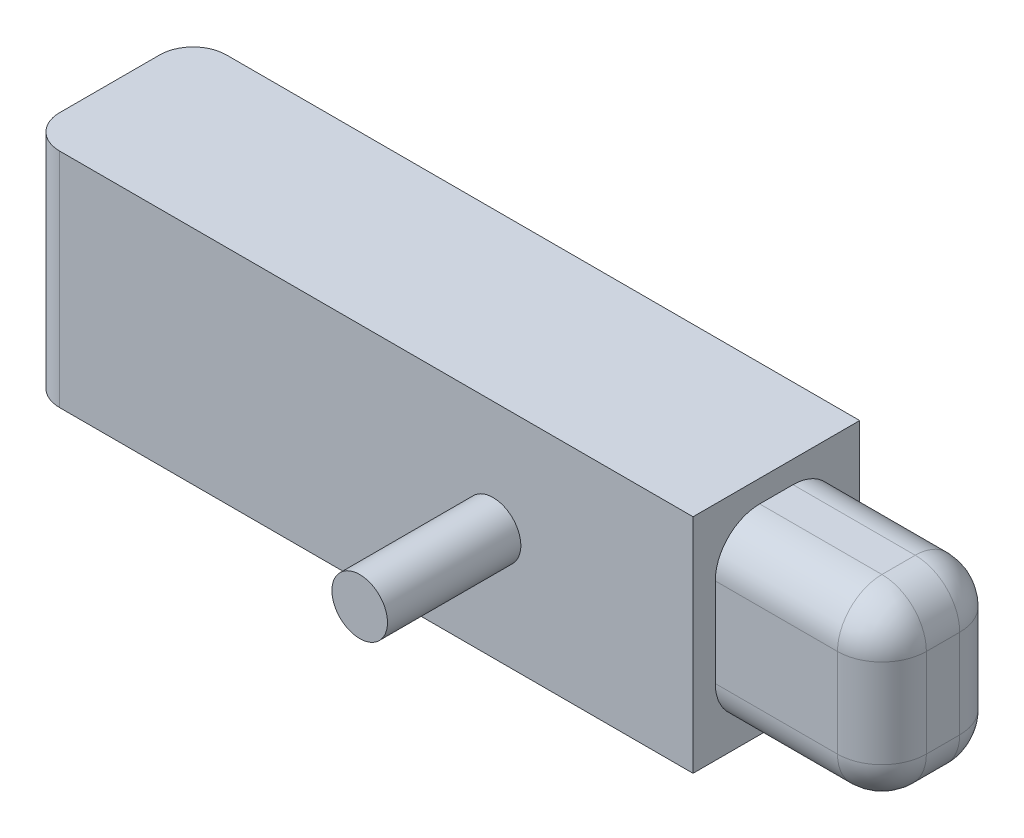
ISO-10303-21;
HEADER;
FILE_DESCRIPTION(('STEP AP214'),'2;1');
FILE_NAME('part.step','',(''),(''),'','','');
FILE_SCHEMA(('AUTOMOTIVE_DESIGN { 1 0 10303 214 1 1 1 1 }'));
ENDSEC;
DATA;
#1=APPLICATION_CONTEXT('core data for automotive mechanical design processes');
#2=APPLICATION_PROTOCOL_DEFINITION('international standard','automotive_design',2000,#1);
#3=PRODUCT_CONTEXT('',#1,'mechanical');
#4=PRODUCT('Part','Part','',(#3));
#5=PRODUCT_RELATED_PRODUCT_CATEGORY('part','',(#4));
#6=PRODUCT_DEFINITION_FORMATION('','',#4);
#7=PRODUCT_DEFINITION_CONTEXT('part definition',#1,'design');
#8=PRODUCT_DEFINITION('design','',#6,#7);
#9=PRODUCT_DEFINITION_SHAPE('','',#8);
#10=(LENGTH_UNIT() NAMED_UNIT(*) SI_UNIT(.MILLI.,.METRE.));
#11=(NAMED_UNIT(*) PLANE_ANGLE_UNIT() SI_UNIT($,.RADIAN.));
#12=(NAMED_UNIT(*) SI_UNIT($,.STERADIAN.) SOLID_ANGLE_UNIT());
#13=UNCERTAINTY_MEASURE_WITH_UNIT(LENGTH_MEASURE(1.E-05),#10,'distance_accuracy_value','');
#14=(GEOMETRIC_REPRESENTATION_CONTEXT(3) GLOBAL_UNCERTAINTY_ASSIGNED_CONTEXT((#13)) GLOBAL_UNIT_ASSIGNED_CONTEXT((#10,
#11,#12)) REPRESENTATION_CONTEXT('',''));
#15=CARTESIAN_POINT('',(0.,0.,0.));
#16=DIRECTION('',(0.,0.,1.));
#17=DIRECTION('',(1.,0.,0.));
#18=AXIS2_PLACEMENT_3D('',#15,#16,#17);
#19=CARTESIAN_POINT('',(55.594721876326,30.,14.8444549595951));
#20=DIRECTION('',(-1.,0.,0.));
#21=DIRECTION('',(0.,0.,1.));
#22=AXIS2_PLACEMENT_3D('',#19,#20,#21);
#23=PLANE('',#22);
#24=DIRECTION('',(0.,0.,-1.));
#25=VECTOR('',#24,1.);
#26=CARTESIAN_POINT('',(55.594721876326,-10.,14.8444549595951));
#27=LINE('',#26,#25);
#28=CARTESIAN_POINT('',(55.594721876326,-10.,14.8444549595951));
#29=VERTEX_POINT('',#28);
#30=CARTESIAN_POINT('',(55.594721876326,-10.,-15.1555450404049));
#31=VERTEX_POINT('',#30);
#32=EDGE_CURVE('E185',#29,#31,#27,.T.);
#33=ORIENTED_EDGE('',*,*,#32,.T.);
#34=DIRECTION('',(0.,-1.,0.));
#35=VECTOR('',#34,1.);
#36=CARTESIAN_POINT('',(55.594721876326,30.,-15.1555450404049));
#37=LINE('',#36,#35);
#38=CARTESIAN_POINT('',(55.594721876326,30.,-15.1555450404049));
#39=VERTEX_POINT('',#38);
#40=EDGE_CURVE('E171',#39,#31,#37,.T.);
#41=ORIENTED_EDGE('',*,*,#40,.F.);
#42=DIRECTION('',(0.,0.,-1.));
#43=VECTOR('',#42,1.);
#44=CARTESIAN_POINT('',(55.594721876326,30.,14.8444549595951));
#45=LINE('',#44,#43);
#46=CARTESIAN_POINT('',(55.594721876326,30.,14.8444549595951));
#47=VERTEX_POINT('',#46);
#48=EDGE_CURVE('E157',#47,#39,#45,.T.);
#49=ORIENTED_EDGE('',*,*,#48,.F.);
#50=DIRECTION('',(0.,-1.,0.));
#51=VECTOR('',#50,1.);
#52=CARTESIAN_POINT('',(55.594721876326,30.,14.8444549595951));
#53=LINE('',#52,#51);
#54=EDGE_CURVE('E164',#47,#29,#53,.T.);
#55=ORIENTED_EDGE('',*,*,#54,.T.);
#56=EDGE_LOOP('',(#33,#41,#49,#55));
#57=FACE_BOUND('',#56,.T.);
#58=DIRECTION('',(0.,-1.,0.));
#59=VECTOR('',#58,1.);
#60=CARTESIAN_POINT('',(55.594721876326,-6.,10.8444549595951));
#61=LINE('',#60,#59);
#62=CARTESIAN_POINT('',(55.594721876326,18.,10.8444549595951));
#63=VERTEX_POINT('',#62);
#64=CARTESIAN_POINT('',(55.594721876326,2.,10.8444549595951));
#65=VERTEX_POINT('',#64);
#66=EDGE_CURVE('E269',#63,#65,#61,.T.);
#67=ORIENTED_EDGE('',*,*,#66,.F.);
#68=CARTESIAN_POINT('',(55.594721876326,18.,2.84445495959507));
#69=DIRECTION('',(-1.,0.,0.));
#70=DIRECTION('',(0.,0.,1.));
#71=AXIS2_PLACEMENT_3D('',#68,#69,#70);
#72=CIRCLE('',#71,8.);
#73=CARTESIAN_POINT('',(55.594721876326,26.,2.84445495959507));
#74=VERTEX_POINT('',#73);
#75=EDGE_CURVE('E218',#63,#74,#72,.T.);
#76=ORIENTED_EDGE('',*,*,#75,.T.);
#77=DIRECTION('',(0.,0.,1.));
#78=VECTOR('',#77,1.);
#79=CARTESIAN_POINT('',(55.594721876326,26.,-11.1555450404049));
#80=LINE('',#79,#78);
#81=CARTESIAN_POINT('',(55.594721876326,26.,-3.15554504040493));
#82=VERTEX_POINT('',#81);
#83=EDGE_CURVE('E554',#82,#74,#80,.T.);
#84=ORIENTED_EDGE('',*,*,#83,.F.);
#85=CARTESIAN_POINT('',(55.594721876326,18.,-3.15554504040493));
#86=DIRECTION('',(-1.,0.,0.));
#87=DIRECTION('',(0.,0.,1.));
#88=AXIS2_PLACEMENT_3D('',#85,#86,#87);
#89=CIRCLE('',#88,8.);
#90=CARTESIAN_POINT('',(55.594721876326,18.,-11.1555450404049));
#91=VERTEX_POINT('',#90);
#92=EDGE_CURVE('E212',#82,#91,#89,.T.);
#93=ORIENTED_EDGE('',*,*,#92,.T.);
#94=DIRECTION('',(0.,1.,0.));
#95=VECTOR('',#94,1.);
#96=CARTESIAN_POINT('',(55.594721876326,-6.,-11.1555450404049));
#97=LINE('',#96,#95);
#98=CARTESIAN_POINT('',(55.594721876326,2.,-11.1555450404049));
#99=VERTEX_POINT('',#98);
#100=EDGE_CURVE('E557',#99,#91,#97,.T.);
#101=ORIENTED_EDGE('',*,*,#100,.F.);
#102=CARTESIAN_POINT('',(55.594721876326,2.,-3.15554504040493));
#103=DIRECTION('',(-1.,0.,0.));
#104=DIRECTION('',(0.,0.,1.));
#105=AXIS2_PLACEMENT_3D('',#102,#103,#104);
#106=CIRCLE('',#105,8.);
#107=CARTESIAN_POINT('',(55.594721876326,-6.,-3.15554504040493));
#108=VERTEX_POINT('',#107);
#109=EDGE_CURVE('E214',#99,#108,#106,.T.);
#110=ORIENTED_EDGE('',*,*,#109,.T.);
#111=DIRECTION('',(0.,0.,-1.));
#112=VECTOR('',#111,1.);
#113=CARTESIAN_POINT('',(55.594721876326,-6.,-11.1555450404049));
#114=LINE('',#113,#112);
#115=CARTESIAN_POINT('',(55.594721876326,-6.,2.84445495959507));
#116=VERTEX_POINT('',#115);
#117=EDGE_CURVE('E562',#116,#108,#114,.T.);
#118=ORIENTED_EDGE('',*,*,#117,.F.);
#119=CARTESIAN_POINT('',(55.594721876326,2.,2.84445495959507));
#120=DIRECTION('',(-1.,0.,0.));
#121=DIRECTION('',(0.,0.,1.));
#122=AXIS2_PLACEMENT_3D('',#119,#120,#121);
#123=CIRCLE('',#122,8.);
#124=EDGE_CURVE('E216',#116,#65,#123,.T.);
#125=ORIENTED_EDGE('',*,*,#124,.T.);
#126=EDGE_LOOP('',(#67,#76,#84,#93,#101,#110,#118,#125));
#127=FACE_BOUND('',#126,.T.);
#128=ADVANCED_FACE('F40',(#57,#127),#23,.F.);
#129=CARTESIAN_POINT('',(-64.405278123674,30.,14.8444549595951));
#130=DIRECTION('',(1.,0.,0.));
#131=DIRECTION('',(0.,0.,-1.));
#132=AXIS2_PLACEMENT_3D('',#129,#130,#131);
#133=PLANE('',#132);
#134=DIRECTION('',(0.,0.,1.));
#135=VECTOR('',#134,1.);
#136=CARTESIAN_POINT('',(-64.405278123674,30.,14.8444549595951));
#137=LINE('',#136,#135);
#138=CARTESIAN_POINT('',(-64.405278123674,30.,-9.15554504040492));
#139=VERTEX_POINT('',#138);
#140=CARTESIAN_POINT('',(-64.405278123674,30.,8.84445495959508));
#141=VERTEX_POINT('',#140);
#142=EDGE_CURVE('E161',#139,#141,#137,.T.);
#143=ORIENTED_EDGE('',*,*,#142,.F.);
#144=DIRECTION('',(0.,-1.,0.));
#145=VECTOR('',#144,1.);
#146=CARTESIAN_POINT('',(-64.405278123674,30.,-9.15554504040492));
#147=LINE('',#146,#145);
#148=CARTESIAN_POINT('',(-64.405278123674,-10.,-9.15554504040492));
#149=VERTEX_POINT('',#148);
#150=EDGE_CURVE('E271',#139,#149,#147,.T.);
#151=ORIENTED_EDGE('',*,*,#150,.T.);
#152=DIRECTION('',(0.,0.,1.));
#153=VECTOR('',#152,1.);
#154=CARTESIAN_POINT('',(-64.405278123674,-10.,14.8444549595951));
#155=LINE('',#154,#153);
#156=CARTESIAN_POINT('',(-64.405278123674,-10.,8.84445495959508));
#157=VERTEX_POINT('',#156);
#158=EDGE_CURVE('E180',#149,#157,#155,.T.);
#159=ORIENTED_EDGE('',*,*,#158,.T.);
#160=DIRECTION('',(0.,-1.,0.));
#161=VECTOR('',#160,1.);
#162=CARTESIAN_POINT('',(-64.405278123674,30.,8.84445495959508));
#163=LINE('',#162,#161);
#164=EDGE_CURVE('E246',#157,#141,#163,.F.);
#165=ORIENTED_EDGE('',*,*,#164,.T.);
#166=EDGE_LOOP('',(#143,#151,#159,#165));
#167=FACE_BOUND('',#166,.T.);
#168=ADVANCED_FACE('F284',(#167),#133,.F.);
#169=CARTESIAN_POINT('',(55.594721876326,30.,14.8444549595951));
#170=DIRECTION('',(0.,0.,-1.));
#171=DIRECTION('',(-1.,0.,0.));
#172=AXIS2_PLACEMENT_3D('',#169,#170,#171);
#173=PLANE('',#172);
#174=CARTESIAN_POINT('',(19.594721876326,10.,14.8444549595951));
#175=DIRECTION('',(0.,0.,-1.));
#176=DIRECTION('',(-1.,0.,0.));
#177=AXIS2_PLACEMENT_3D('',#174,#175,#176);
#178=CIRCLE('',#177,5.);
#179=CARTESIAN_POINT('',(14.594721876326,10.,14.8444549595951));
#180=VERTEX_POINT('',#179);
#181=EDGE_CURVE('E170',#180,#180,#178,.F.);
#182=ORIENTED_EDGE('',*,*,#181,.F.);
#183=EDGE_LOOP('',(#182));
#184=FACE_BOUND('',#183,.T.);
#185=DIRECTION('',(1.,0.,0.));
#186=VECTOR('',#185,1.);
#187=CARTESIAN_POINT('',(55.594721876326,30.,14.8444549595951));
#188=LINE('',#187,#186);
#189=CARTESIAN_POINT('',(-58.405278123674,30.,14.8444549595951));
#190=VERTEX_POINT('',#189);
#191=EDGE_CURVE('E153',#190,#47,#188,.T.);
#192=ORIENTED_EDGE('',*,*,#191,.F.);
#193=DIRECTION('',(0.,-1.,0.));
#194=VECTOR('',#193,1.);
#195=CARTESIAN_POINT('',(-58.405278123674,30.,14.8444549595951));
#196=LINE('',#195,#194);
#197=CARTESIAN_POINT('',(-58.405278123674,-10.,14.8444549595951));
#198=VERTEX_POINT('',#197);
#199=EDGE_CURVE('E11',#190,#198,#196,.T.);
#200=ORIENTED_EDGE('',*,*,#199,.T.);
#201=DIRECTION('',(1.,0.,0.));
#202=VECTOR('',#201,1.);
#203=CARTESIAN_POINT('',(55.594721876326,-10.,14.8444549595951));
#204=LINE('',#203,#202);
#205=EDGE_CURVE('E167',#198,#29,#204,.T.);
#206=ORIENTED_EDGE('',*,*,#205,.T.);
#207=ORIENTED_EDGE('',*,*,#54,.F.);
#208=EDGE_LOOP('',(#192,#200,#206,#207));
#209=FACE_BOUND('',#208,.T.);
#210=ADVANCED_FACE('F165',(#184,#209),#173,.F.);
#211=CARTESIAN_POINT('',(55.594721876326,30.,-15.1555450404049));
#212=DIRECTION('',(0.,0.,1.));
#213=DIRECTION('',(1.,0.,0.));
#214=AXIS2_PLACEMENT_3D('',#211,#212,#213);
#215=PLANE('',#214);
#216=DIRECTION('',(-1.,0.,0.));
#217=VECTOR('',#216,1.);
#218=CARTESIAN_POINT('',(55.594721876326,-10.,-15.1555450404049));
#219=LINE('',#218,#217);
#220=CARTESIAN_POINT('',(-58.405278123674,-10.,-15.1555450404049));
#221=VERTEX_POINT('',#220);
#222=EDGE_CURVE('E187',#31,#221,#219,.T.);
#223=ORIENTED_EDGE('',*,*,#222,.T.);
#224=DIRECTION('',(0.,-1.,0.));
#225=VECTOR('',#224,1.);
#226=CARTESIAN_POINT('',(-58.405278123674,30.,-15.1555450404049));
#227=LINE('',#226,#225);
#228=CARTESIAN_POINT('',(-58.405278123674,30.,-15.1555450404049));
#229=VERTEX_POINT('',#228);
#230=EDGE_CURVE('E63',#221,#229,#227,.F.);
#231=ORIENTED_EDGE('',*,*,#230,.T.);
#232=DIRECTION('',(-1.,0.,0.));
#233=VECTOR('',#232,1.);
#234=CARTESIAN_POINT('',(55.594721876326,30.,-15.1555450404049));
#235=LINE('',#234,#233);
#236=EDGE_CURVE('E175',#39,#229,#235,.T.);
#237=ORIENTED_EDGE('',*,*,#236,.F.);
#238=ORIENTED_EDGE('',*,*,#40,.T.);
#239=EDGE_LOOP('',(#223,#231,#237,#238));
#240=FACE_BOUND('',#239,.T.);
#241=ADVANCED_FACE('F291',(#240),#215,.F.);
#242=CARTESIAN_POINT('',(-4.40527812367396,30.,-0.155545040404923));
#243=DIRECTION('',(0.,1.,0.));
#244=DIRECTION('',(0.,0.,1.));
#245=AXIS2_PLACEMENT_3D('',#242,#243,#244);
#246=PLANE('',#245);
#247=ORIENTED_EDGE('',*,*,#236,.T.);
#248=CARTESIAN_POINT('',(-58.405278123674,30.,-9.15554504040492));
#249=DIRECTION('',(0.,1.,0.));
#250=DIRECTION('',(0.,0.,1.));
#251=AXIS2_PLACEMENT_3D('',#248,#249,#250);
#252=CIRCLE('',#251,6.);
#253=EDGE_CURVE('E48',#229,#139,#252,.T.);
#254=ORIENTED_EDGE('',*,*,#253,.T.);
#255=ORIENTED_EDGE('',*,*,#142,.T.);
#256=CARTESIAN_POINT('',(-58.405278123674,30.,8.84445495959508));
#257=DIRECTION('',(0.,1.,0.));
#258=DIRECTION('',(0.,0.,1.));
#259=AXIS2_PLACEMENT_3D('',#256,#257,#258);
#260=CIRCLE('',#259,6.);
#261=EDGE_CURVE('E55',#141,#190,#260,.T.);
#262=ORIENTED_EDGE('',*,*,#261,.T.);
#263=ORIENTED_EDGE('',*,*,#191,.T.);
#264=ORIENTED_EDGE('',*,*,#48,.T.);
#265=EDGE_LOOP('',(#247,#254,#255,#262,#263,#264));
#266=FACE_BOUND('',#265,.T.);
#267=ADVANCED_FACE('F155',(#266),#246,.T.);
#268=CARTESIAN_POINT('',(-4.40527812367396,-10.,-0.155545040404923));
#269=DIRECTION('',(0.,1.,0.));
#270=DIRECTION('',(0.,0.,1.));
#271=AXIS2_PLACEMENT_3D('',#268,#269,#270);
#272=PLANE('',#271);
#273=ORIENTED_EDGE('',*,*,#158,.F.);
#274=CARTESIAN_POINT('',(-58.405278123674,-10.,-9.15554504040492));
#275=DIRECTION('',(0.,1.,0.));
#276=DIRECTION('',(0.,0.,1.));
#277=AXIS2_PLACEMENT_3D('',#274,#275,#276);
#278=CIRCLE('',#277,6.);
#279=EDGE_CURVE('E276',#149,#221,#278,.F.);
#280=ORIENTED_EDGE('',*,*,#279,.T.);
#281=ORIENTED_EDGE('',*,*,#222,.F.);
#282=ORIENTED_EDGE('',*,*,#32,.F.);
#283=ORIENTED_EDGE('',*,*,#205,.F.);
#284=CARTESIAN_POINT('',(-58.405278123674,-10.,8.84445495959508));
#285=DIRECTION('',(0.,1.,0.));
#286=DIRECTION('',(0.,0.,1.));
#287=AXIS2_PLACEMENT_3D('',#284,#285,#286);
#288=CIRCLE('',#287,6.);
#289=EDGE_CURVE('E274',#198,#157,#288,.F.);
#290=ORIENTED_EDGE('',*,*,#289,.T.);
#291=EDGE_LOOP('',(#273,#280,#281,#282,#283,#290));
#292=FACE_BOUND('',#291,.T.);
#293=ADVANCED_FACE('F290',(#292),#272,.F.);
#294=CARTESIAN_POINT('',(19.594721876326,10.,38.8444549595951));
#295=DIRECTION('',(0.,0.,-1.));
#296=DIRECTION('',(-1.,0.,0.));
#297=AXIS2_PLACEMENT_3D('',#294,#295,#296);
#298=CYLINDRICAL_SURFACE('',#297,5.);
#299=CARTESIAN_POINT('',(19.594721876326,10.,38.8444549595951));
#300=DIRECTION('',(0.,0.,1.));
#301=DIRECTION('',(1.,0.,0.));
#302=AXIS2_PLACEMENT_3D('',#299,#300,#301);
#303=CIRCLE('',#302,5.);
#304=CARTESIAN_POINT('',(24.594721876326,10.,38.8444549595951));
#305=VERTEX_POINT('',#304);
#306=EDGE_CURVE('E183',#305,#305,#303,.T.);
#307=ORIENTED_EDGE('',*,*,#306,.F.);
#308=EDGE_LOOP('',(#307));
#309=FACE_BOUND('',#308,.T.);
#310=ORIENTED_EDGE('',*,*,#181,.T.);
#311=EDGE_LOOP('',(#310));
#312=FACE_BOUND('',#311,.T.);
#313=ADVANCED_FACE('F504',(#309,#312),#298,.T.);
#314=CARTESIAN_POINT('',(19.594721876326,10.,38.8444549595951));
#315=DIRECTION('',(0.,0.,1.));
#316=DIRECTION('',(1.,0.,0.));
#317=AXIS2_PLACEMENT_3D('',#314,#315,#316);
#318=PLANE('',#317);
#319=ORIENTED_EDGE('',*,*,#306,.T.);
#320=EDGE_LOOP('',(#319));
#321=FACE_BOUND('',#320,.T.);
#322=ADVANCED_FACE('F493',(#321),#318,.T.);
#323=CARTESIAN_POINT('',(85.594721876326,-6.,10.8444549595951));
#324=DIRECTION('',(0.,0.,-1.));
#325=DIRECTION('',(-1.,0.,0.));
#326=AXIS2_PLACEMENT_3D('',#323,#324,#325);
#327=PLANE('',#326);
#328=DIRECTION('',(-1.,0.,0.));
#329=VECTOR('',#328,1.);
#330=CARTESIAN_POINT('',(85.594721876326,2.,10.8444549595951));
#331=LINE('',#330,#329);
#332=CARTESIAN_POINT('',(77.594721876326,2.,10.8444549595951));
#333=VERTEX_POINT('',#332);
#334=EDGE_CURVE('E209',#65,#333,#331,.F.);
#335=ORIENTED_EDGE('',*,*,#334,.T.);
#336=DIRECTION('',(0.,-1.,0.));
#337=VECTOR('',#336,1.);
#338=CARTESIAN_POINT('',(77.594721876326,18.,10.8444549595951));
#339=LINE('',#338,#337);
#340=CARTESIAN_POINT('',(77.594721876326,18.,10.8444549595951));
#341=VERTEX_POINT('',#340);
#342=EDGE_CURVE('E236',#333,#341,#339,.F.);
#343=ORIENTED_EDGE('',*,*,#342,.T.);
#344=DIRECTION('',(-1.,0.,0.));
#345=VECTOR('',#344,1.);
#346=CARTESIAN_POINT('',(85.594721876326,18.,10.8444549595951));
#347=LINE('',#346,#345);
#348=EDGE_CURVE('E207',#341,#63,#347,.T.);
#349=ORIENTED_EDGE('',*,*,#348,.T.);
#350=ORIENTED_EDGE('',*,*,#66,.T.);
#351=EDGE_LOOP('',(#335,#343,#349,#350));
#352=FACE_BOUND('',#351,.T.);
#353=ADVANCED_FACE('F483',(#352),#327,.F.);
#354=CARTESIAN_POINT('',(85.594721876326,-6.,-11.1555450404049));
#355=DIRECTION('',(0.,1.,0.));
#356=DIRECTION('',(0.,0.,1.));
#357=AXIS2_PLACEMENT_3D('',#354,#355,#356);
#358=PLANE('',#357);
#359=DIRECTION('',(-1.,0.,0.));
#360=VECTOR('',#359,1.);
#361=CARTESIAN_POINT('',(85.594721876326,-6.,-3.15554504040493));
#362=LINE('',#361,#360);
#363=CARTESIAN_POINT('',(77.594721876326,-6.,-3.15554504040493));
#364=VERTEX_POINT('',#363);
#365=EDGE_CURVE('E204',#108,#364,#362,.F.);
#366=ORIENTED_EDGE('',*,*,#365,.T.);
#367=DIRECTION('',(0.,0.,-1.));
#368=VECTOR('',#367,1.);
#369=CARTESIAN_POINT('',(77.594721876326,-6.,2.84445495959507));
#370=LINE('',#369,#368);
#371=CARTESIAN_POINT('',(77.594721876326,-6.,2.84445495959507));
#372=VERTEX_POINT('',#371);
#373=EDGE_CURVE('E232',#364,#372,#370,.F.);
#374=ORIENTED_EDGE('',*,*,#373,.T.);
#375=DIRECTION('',(-1.,0.,0.));
#376=VECTOR('',#375,1.);
#377=CARTESIAN_POINT('',(85.594721876326,-6.,2.84445495959507));
#378=LINE('',#377,#376);
#379=EDGE_CURVE('E202',#372,#116,#378,.T.);
#380=ORIENTED_EDGE('',*,*,#379,.T.);
#381=ORIENTED_EDGE('',*,*,#117,.T.);
#382=EDGE_LOOP('',(#366,#374,#380,#381));
#383=FACE_BOUND('',#382,.T.);
#384=ADVANCED_FACE('F473',(#383),#358,.F.);
#385=CARTESIAN_POINT('',(85.594721876326,-6.,-11.1555450404049));
#386=DIRECTION('',(0.,0.,1.));
#387=DIRECTION('',(1.,0.,0.));
#388=AXIS2_PLACEMENT_3D('',#385,#386,#387);
#389=PLANE('',#388);
#390=DIRECTION('',(-1.,0.,0.));
#391=VECTOR('',#390,1.);
#392=CARTESIAN_POINT('',(85.594721876326,18.,-11.1555450404049));
#393=LINE('',#392,#391);
#394=CARTESIAN_POINT('',(77.594721876326,18.,-11.1555450404049));
#395=VERTEX_POINT('',#394);
#396=EDGE_CURVE('E199',#91,#395,#393,.F.);
#397=ORIENTED_EDGE('',*,*,#396,.T.);
#398=DIRECTION('',(0.,1.,0.));
#399=VECTOR('',#398,1.);
#400=CARTESIAN_POINT('',(77.594721876326,2.,-11.1555450404049));
#401=LINE('',#400,#399);
#402=CARTESIAN_POINT('',(77.594721876326,2.,-11.1555450404049));
#403=VERTEX_POINT('',#402);
#404=EDGE_CURVE('E244',#395,#403,#401,.F.);
#405=ORIENTED_EDGE('',*,*,#404,.T.);
#406=DIRECTION('',(-1.,0.,0.));
#407=VECTOR('',#406,1.);
#408=CARTESIAN_POINT('',(85.594721876326,2.,-11.1555450404049));
#409=LINE('',#408,#407);
#410=EDGE_CURVE('E197',#403,#99,#409,.T.);
#411=ORIENTED_EDGE('',*,*,#410,.T.);
#412=ORIENTED_EDGE('',*,*,#100,.T.);
#413=EDGE_LOOP('',(#397,#405,#411,#412));
#414=FACE_BOUND('',#413,.T.);
#415=ADVANCED_FACE('F463',(#414),#389,.F.);
#416=CARTESIAN_POINT('',(85.594721876326,26.,-11.1555450404049));
#417=DIRECTION('',(0.,-1.,0.));
#418=DIRECTION('',(0.,0.,-1.));
#419=AXIS2_PLACEMENT_3D('',#416,#417,#418);
#420=PLANE('',#419);
#421=DIRECTION('',(-1.,0.,0.));
#422=VECTOR('',#421,1.);
#423=CARTESIAN_POINT('',(85.594721876326,26.,2.84445495959507));
#424=LINE('',#423,#422);
#425=CARTESIAN_POINT('',(77.594721876326,26.,2.84445495959507));
#426=VERTEX_POINT('',#425);
#427=EDGE_CURVE('E192',#74,#426,#424,.F.);
#428=ORIENTED_EDGE('',*,*,#427,.T.);
#429=DIRECTION('',(0.,0.,1.));
#430=VECTOR('',#429,1.);
#431=CARTESIAN_POINT('',(77.594721876326,26.,-3.15554504040493));
#432=LINE('',#431,#430);
#433=CARTESIAN_POINT('',(77.594721876326,26.,-3.15554504040493));
#434=VERTEX_POINT('',#433);
#435=EDGE_CURVE('E240',#426,#434,#432,.F.);
#436=ORIENTED_EDGE('',*,*,#435,.T.);
#437=DIRECTION('',(-1.,0.,0.));
#438=VECTOR('',#437,1.);
#439=CARTESIAN_POINT('',(85.594721876326,26.,-3.15554504040493));
#440=LINE('',#439,#438);
#441=EDGE_CURVE('E195',#434,#82,#440,.T.);
#442=ORIENTED_EDGE('',*,*,#441,.T.);
#443=ORIENTED_EDGE('',*,*,#83,.T.);
#444=EDGE_LOOP('',(#428,#436,#442,#443));
#445=FACE_BOUND('',#444,.T.);
#446=ADVANCED_FACE('F453',(#445),#420,.F.);
#447=CARTESIAN_POINT('',(85.594721876326,-10.,-0.155545040404923));
#448=DIRECTION('',(1.,0.,0.));
#449=DIRECTION('',(0.,0.,-1.));
#450=AXIS2_PLACEMENT_3D('',#447,#448,#449);
#451=PLANE('',#450);
#452=DIRECTION('',(0.,-1.,0.));
#453=VECTOR('',#452,1.);
#454=CARTESIAN_POINT('',(85.594721876326,2.,2.84445495959507));
#455=LINE('',#454,#453);
#456=CARTESIAN_POINT('',(85.594721876326,18.,2.84445495959507));
#457=VERTEX_POINT('',#456);
#458=CARTESIAN_POINT('',(85.594721876326,2.,2.84445495959507));
#459=VERTEX_POINT('',#458);
#460=EDGE_CURVE('E227',#457,#459,#455,.T.);
#461=ORIENTED_EDGE('',*,*,#460,.T.);
#462=DIRECTION('',(0.,0.,-1.));
#463=VECTOR('',#462,1.);
#464=CARTESIAN_POINT('',(85.594721876326,2.,-3.15554504040493));
#465=LINE('',#464,#463);
#466=CARTESIAN_POINT('',(85.594721876326,2.,-3.15554504040493));
#467=VERTEX_POINT('',#466);
#468=EDGE_CURVE('E229',#459,#467,#465,.T.);
#469=ORIENTED_EDGE('',*,*,#468,.T.);
#470=DIRECTION('',(0.,1.,0.));
#471=VECTOR('',#470,1.);
#472=CARTESIAN_POINT('',(85.594721876326,18.,-3.15554504040493));
#473=LINE('',#472,#471);
#474=CARTESIAN_POINT('',(85.594721876326,18.,-3.15554504040493));
#475=VERTEX_POINT('',#474);
#476=EDGE_CURVE('E223',#467,#475,#473,.T.);
#477=ORIENTED_EDGE('',*,*,#476,.T.);
#478=DIRECTION('',(0.,0.,1.));
#479=VECTOR('',#478,1.);
#480=CARTESIAN_POINT('',(85.594721876326,18.,2.84445495959507));
#481=LINE('',#480,#479);
#482=EDGE_CURVE('E225',#475,#457,#481,.T.);
#483=ORIENTED_EDGE('',*,*,#482,.T.);
#484=EDGE_LOOP('',(#461,#469,#477,#483));
#485=FACE_BOUND('',#484,.T.);
#486=ADVANCED_FACE('F313',(#485),#451,.T.);
#487=CARTESIAN_POINT('',(85.594721876326,18.,-3.15554504040493));
#488=DIRECTION('',(-1.,0.,0.));
#489=DIRECTION('',(0.,0.,1.));
#490=AXIS2_PLACEMENT_3D('',#487,#488,#489);
#491=CYLINDRICAL_SURFACE('',#490,8.);
#492=ORIENTED_EDGE('',*,*,#441,.F.);
#493=CARTESIAN_POINT('',(77.594721876326,18.,-3.15554504040493));
#494=DIRECTION('',(-1.,0.,0.));
#495=DIRECTION('',(0.,0.,1.));
#496=AXIS2_PLACEMENT_3D('',#493,#494,#495);
#497=CIRCLE('',#496,8.);
#498=EDGE_CURVE('E242',#434,#395,#497,.T.);
#499=ORIENTED_EDGE('',*,*,#498,.T.);
#500=ORIENTED_EDGE('',*,*,#396,.F.);
#501=ORIENTED_EDGE('',*,*,#92,.F.);
#502=EDGE_LOOP('',(#492,#499,#500,#501));
#503=FACE_BOUND('',#502,.T.);
#504=ADVANCED_FACE('F309',(#503),#491,.T.);
#505=CARTESIAN_POINT('',(85.594721876326,2.,-3.15554504040493));
#506=DIRECTION('',(-1.,0.,0.));
#507=DIRECTION('',(0.,0.,1.));
#508=AXIS2_PLACEMENT_3D('',#505,#506,#507);
#509=CYLINDRICAL_SURFACE('',#508,8.);
#510=ORIENTED_EDGE('',*,*,#410,.F.);
#511=CARTESIAN_POINT('',(77.594721876326,2.,-3.15554504040493));
#512=DIRECTION('',(-1.,0.,0.));
#513=DIRECTION('',(0.,0.,1.));
#514=AXIS2_PLACEMENT_3D('',#511,#512,#513);
#515=CIRCLE('',#514,8.);
#516=EDGE_CURVE('E220',#403,#364,#515,.T.);
#517=ORIENTED_EDGE('',*,*,#516,.T.);
#518=ORIENTED_EDGE('',*,*,#365,.F.);
#519=ORIENTED_EDGE('',*,*,#109,.F.);
#520=EDGE_LOOP('',(#510,#517,#518,#519));
#521=FACE_BOUND('',#520,.T.);
#522=ADVANCED_FACE('F312',(#521),#509,.T.);
#523=CARTESIAN_POINT('',(85.594721876326,2.,2.84445495959507));
#524=DIRECTION('',(-1.,0.,0.));
#525=DIRECTION('',(0.,0.,1.));
#526=AXIS2_PLACEMENT_3D('',#523,#524,#525);
#527=CYLINDRICAL_SURFACE('',#526,8.);
#528=ORIENTED_EDGE('',*,*,#379,.F.);
#529=CARTESIAN_POINT('',(77.594721876326,2.,2.84445495959507));
#530=DIRECTION('',(-1.,0.,0.));
#531=DIRECTION('',(0.,0.,1.));
#532=AXIS2_PLACEMENT_3D('',#529,#530,#531);
#533=CIRCLE('',#532,8.);
#534=EDGE_CURVE('E234',#372,#333,#533,.T.);
#535=ORIENTED_EDGE('',*,*,#534,.T.);
#536=ORIENTED_EDGE('',*,*,#334,.F.);
#537=ORIENTED_EDGE('',*,*,#124,.F.);
#538=EDGE_LOOP('',(#528,#535,#536,#537));
#539=FACE_BOUND('',#538,.T.);
#540=ADVANCED_FACE('F317',(#539),#527,.T.);
#541=CARTESIAN_POINT('',(85.594721876326,18.,2.84445495959507));
#542=DIRECTION('',(-1.,0.,0.));
#543=DIRECTION('',(0.,0.,1.));
#544=AXIS2_PLACEMENT_3D('',#541,#542,#543);
#545=CYLINDRICAL_SURFACE('',#544,8.);
#546=ORIENTED_EDGE('',*,*,#348,.F.);
#547=CARTESIAN_POINT('',(77.594721876326,18.,2.84445495959507));
#548=DIRECTION('',(-1.,0.,0.));
#549=DIRECTION('',(0.,0.,1.));
#550=AXIS2_PLACEMENT_3D('',#547,#548,#549);
#551=CIRCLE('',#550,8.);
#552=EDGE_CURVE('E238',#341,#426,#551,.T.);
#553=ORIENTED_EDGE('',*,*,#552,.T.);
#554=ORIENTED_EDGE('',*,*,#427,.F.);
#555=ORIENTED_EDGE('',*,*,#75,.F.);
#556=EDGE_LOOP('',(#546,#553,#554,#555));
#557=FACE_BOUND('',#556,.T.);
#558=ADVANCED_FACE('F321',(#557),#545,.T.);
#559=CARTESIAN_POINT('',(77.594721876326,18.,2.84445495959507));
#560=DIRECTION('',(1.,0.,0.));
#561=DIRECTION('',(0.,0.,-1.));
#562=AXIS2_PLACEMENT_3D('',#559,#560,#561);
#563=SPHERICAL_SURFACE('',#562,8.);
#564=CARTESIAN_POINT('',(77.594721876326,18.,2.84445495959507));
#565=DIRECTION('',(0.,0.,-1.));
#566=DIRECTION('',(-1.,0.,0.));
#567=AXIS2_PLACEMENT_3D('',#564,#565,#566);
#568=CIRCLE('',#567,8.);
#569=EDGE_CURVE('E263',#426,#457,#568,.T.);
#570=ORIENTED_EDGE('',*,*,#569,.F.);
#571=ORIENTED_EDGE('',*,*,#552,.F.);
#572=CARTESIAN_POINT('',(77.594721876326,18.,2.84445495959507));
#573=DIRECTION('',(0.,-1.,0.));
#574=DIRECTION('',(0.,0.,-1.));
#575=AXIS2_PLACEMENT_3D('',#572,#573,#574);
#576=CIRCLE('',#575,8.);
#577=EDGE_CURVE('E266',#457,#341,#576,.T.);
#578=ORIENTED_EDGE('',*,*,#577,.F.);
#579=EDGE_LOOP('',(#570,#571,#578));
#580=FACE_BOUND('',#579,.T.);
#581=ADVANCED_FACE('F325',(#580),#563,.T.);
#582=CARTESIAN_POINT('',(77.594721876326,-10.,2.84445495959507));
#583=DIRECTION('',(0.,1.,0.));
#584=DIRECTION('',(0.,0.,1.));
#585=AXIS2_PLACEMENT_3D('',#582,#583,#584);
#586=CYLINDRICAL_SURFACE('',#585,8.);
#587=ORIENTED_EDGE('',*,*,#577,.T.);
#588=ORIENTED_EDGE('',*,*,#342,.F.);
#589=CARTESIAN_POINT('',(77.594721876326,2.,2.84445495959507));
#590=DIRECTION('',(0.,-1.,0.));
#591=DIRECTION('',(0.,0.,-1.));
#592=AXIS2_PLACEMENT_3D('',#589,#590,#591);
#593=CIRCLE('',#592,8.);
#594=EDGE_CURVE('E260',#459,#333,#593,.T.);
#595=ORIENTED_EDGE('',*,*,#594,.F.);
#596=ORIENTED_EDGE('',*,*,#460,.F.);
#597=EDGE_LOOP('',(#587,#588,#595,#596));
#598=FACE_BOUND('',#597,.T.);
#599=ADVANCED_FACE('F350',(#598),#586,.T.);
#600=CARTESIAN_POINT('',(77.594721876326,18.,-0.155545040404923));
#601=DIRECTION('',(0.,0.,-1.));
#602=DIRECTION('',(-1.,0.,0.));
#603=AXIS2_PLACEMENT_3D('',#600,#601,#602);
#604=CYLINDRICAL_SURFACE('',#603,8.);
#605=ORIENTED_EDGE('',*,*,#569,.T.);
#606=ORIENTED_EDGE('',*,*,#482,.F.);
#607=CARTESIAN_POINT('',(77.594721876326,18.,-3.15554504040493));
#608=DIRECTION('',(0.,0.,-1.));
#609=DIRECTION('',(-1.,0.,0.));
#610=AXIS2_PLACEMENT_3D('',#607,#608,#609);
#611=CIRCLE('',#610,8.);
#612=EDGE_CURVE('E257',#434,#475,#611,.T.);
#613=ORIENTED_EDGE('',*,*,#612,.F.);
#614=ORIENTED_EDGE('',*,*,#435,.F.);
#615=EDGE_LOOP('',(#605,#606,#613,#614));
#616=FACE_BOUND('',#615,.T.);
#617=ADVANCED_FACE('F346',(#616),#604,.T.);
#618=CARTESIAN_POINT('',(77.594721876326,2.,2.84445495959507));
#619=DIRECTION('',(1.,0.,0.));
#620=DIRECTION('',(0.,0.,-1.));
#621=AXIS2_PLACEMENT_3D('',#618,#619,#620);
#622=SPHERICAL_SURFACE('',#621,8.);
#623=ORIENTED_EDGE('',*,*,#594,.T.);
#624=ORIENTED_EDGE('',*,*,#534,.F.);
#625=CARTESIAN_POINT('',(77.594721876326,2.,2.84445495959507));
#626=DIRECTION('',(0.,0.,-1.));
#627=DIRECTION('',(-1.,0.,0.));
#628=AXIS2_PLACEMENT_3D('',#625,#626,#627);
#629=CIRCLE('',#628,8.);
#630=EDGE_CURVE('E254',#459,#372,#629,.T.);
#631=ORIENTED_EDGE('',*,*,#630,.F.);
#632=EDGE_LOOP('',(#623,#624,#631));
#633=FACE_BOUND('',#632,.T.);
#634=ADVANCED_FACE('F342',(#633),#622,.T.);
#635=CARTESIAN_POINT('',(77.594721876326,18.,-3.15554504040493));
#636=DIRECTION('',(1.,0.,0.));
#637=DIRECTION('',(0.,0.,-1.));
#638=AXIS2_PLACEMENT_3D('',#635,#636,#637);
#639=SPHERICAL_SURFACE('',#638,8.);
#640=ORIENTED_EDGE('',*,*,#498,.F.);
#641=ORIENTED_EDGE('',*,*,#612,.T.);
#642=CARTESIAN_POINT('',(77.594721876326,18.,-3.15554504040493));
#643=DIRECTION('',(0.,-1.,0.));
#644=DIRECTION('',(0.,0.,-1.));
#645=AXIS2_PLACEMENT_3D('',#642,#643,#644);
#646=CIRCLE('',#645,8.);
#647=EDGE_CURVE('E251',#395,#475,#646,.T.);
#648=ORIENTED_EDGE('',*,*,#647,.F.);
#649=EDGE_LOOP('',(#640,#641,#648));
#650=FACE_BOUND('',#649,.T.);
#651=ADVANCED_FACE('F338',(#650),#639,.T.);
#652=CARTESIAN_POINT('',(77.594721876326,2.,-0.155545040404921));
#653=DIRECTION('',(0.,0.,1.));
#654=DIRECTION('',(0.,-1.,0.));
#655=AXIS2_PLACEMENT_3D('',#652,#653,#654);
#656=CYLINDRICAL_SURFACE('',#655,8.);
#657=ORIENTED_EDGE('',*,*,#630,.T.);
#658=ORIENTED_EDGE('',*,*,#373,.F.);
#659=CARTESIAN_POINT('',(77.594721876326,2.,-3.15554504040493));
#660=DIRECTION('',(0.,0.,-1.));
#661=DIRECTION('',(-1.,0.,0.));
#662=AXIS2_PLACEMENT_3D('',#659,#660,#661);
#663=CIRCLE('',#662,8.);
#664=EDGE_CURVE('E249',#467,#364,#663,.T.);
#665=ORIENTED_EDGE('',*,*,#664,.F.);
#666=ORIENTED_EDGE('',*,*,#468,.F.);
#667=EDGE_LOOP('',(#657,#658,#665,#666));
#668=FACE_BOUND('',#667,.T.);
#669=ADVANCED_FACE('F334',(#668),#656,.T.);
#670=CARTESIAN_POINT('',(77.594721876326,-10.,-3.15554504040493));
#671=DIRECTION('',(0.,-1.,0.));
#672=DIRECTION('',(0.,0.,-1.));
#673=AXIS2_PLACEMENT_3D('',#670,#671,#672);
#674=CYLINDRICAL_SURFACE('',#673,8.);
#675=ORIENTED_EDGE('',*,*,#647,.T.);
#676=ORIENTED_EDGE('',*,*,#476,.F.);
#677=CARTESIAN_POINT('',(77.594721876326,2.,-3.15554504040493));
#678=DIRECTION('',(0.,-1.,0.));
#679=DIRECTION('',(0.,0.,-1.));
#680=AXIS2_PLACEMENT_3D('',#677,#678,#679);
#681=CIRCLE('',#680,8.);
#682=EDGE_CURVE('E247',#403,#467,#681,.T.);
#683=ORIENTED_EDGE('',*,*,#682,.F.);
#684=ORIENTED_EDGE('',*,*,#404,.F.);
#685=EDGE_LOOP('',(#675,#676,#683,#684));
#686=FACE_BOUND('',#685,.T.);
#687=ADVANCED_FACE('F330',(#686),#674,.T.);
#688=CARTESIAN_POINT('',(77.594721876326,2.,-3.15554504040493));
#689=DIRECTION('',(1.,0.,0.));
#690=DIRECTION('',(0.,0.,-1.));
#691=AXIS2_PLACEMENT_3D('',#688,#689,#690);
#692=SPHERICAL_SURFACE('',#691,8.);
#693=ORIENTED_EDGE('',*,*,#664,.T.);
#694=ORIENTED_EDGE('',*,*,#516,.F.);
#695=ORIENTED_EDGE('',*,*,#682,.T.);
#696=EDGE_LOOP('',(#693,#694,#695));
#697=FACE_BOUND('',#696,.T.);
#698=ADVANCED_FACE('F327',(#697),#692,.T.);
#699=CARTESIAN_POINT('',(-58.405278123674,30.,-9.15554504040492));
#700=DIRECTION('',(0.,-1.,0.));
#701=DIRECTION('',(0.,0.,-1.));
#702=AXIS2_PLACEMENT_3D('',#699,#700,#701);
#703=CYLINDRICAL_SURFACE('',#702,6.);
#704=ORIENTED_EDGE('',*,*,#253,.F.);
#705=ORIENTED_EDGE('',*,*,#230,.F.);
#706=ORIENTED_EDGE('',*,*,#279,.F.);
#707=ORIENTED_EDGE('',*,*,#150,.F.);
#708=EDGE_LOOP('',(#704,#705,#706,#707));
#709=FACE_BOUND('',#708,.T.);
#710=ADVANCED_FACE('F287',(#709),#703,.T.);
#711=CARTESIAN_POINT('',(-58.405278123674,30.,8.84445495959508));
#712=DIRECTION('',(0.,-1.,0.));
#713=DIRECTION('',(0.,0.,-1.));
#714=AXIS2_PLACEMENT_3D('',#711,#712,#713);
#715=CYLINDRICAL_SURFACE('',#714,6.);
#716=ORIENTED_EDGE('',*,*,#261,.F.);
#717=ORIENTED_EDGE('',*,*,#164,.F.);
#718=ORIENTED_EDGE('',*,*,#289,.F.);
#719=ORIENTED_EDGE('',*,*,#199,.F.);
#720=EDGE_LOOP('',(#716,#717,#718,#719));
#721=FACE_BOUND('',#720,.T.);
#722=ADVANCED_FACE('F42',(#721),#715,.T.);
#723=CLOSED_SHELL('',(#128,#168,#210,#241,#267,#293,#313,#322,#353,#384,#415,#446,#486,#504,
#522,#540,#558,#581,#599,#617,#634,#651,#669,#687,#698,#710,#722));
#724=MANIFOLD_SOLID_BREP('B2',#723);
#725=ADVANCED_BREP_SHAPE_REPRESENTATION('',(#18,#724),#14);
#726=SHAPE_DEFINITION_REPRESENTATION(#9,#725);
ENDSEC;
END-ISO-10303-21;
